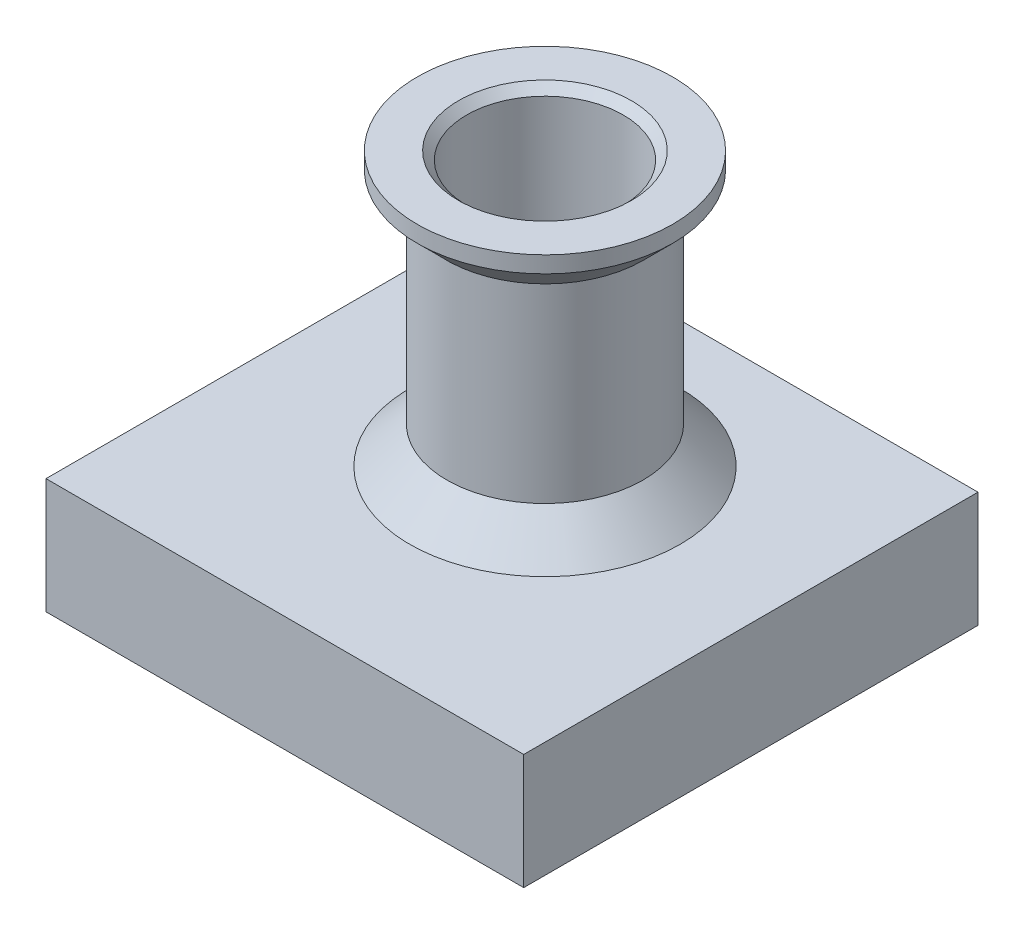
ISO-10303-21;
HEADER;
FILE_DESCRIPTION(('STEP AP214'),'2;1');
FILE_NAME('part.step','',(''),(''),'','','');
FILE_SCHEMA(('AUTOMOTIVE_DESIGN { 1 0 10303 214 1 1 1 1 }'));
ENDSEC;
DATA;
#1=APPLICATION_CONTEXT('core data for automotive mechanical design processes');
#2=APPLICATION_PROTOCOL_DEFINITION('international standard','automotive_design',2000,#1);
#3=PRODUCT_CONTEXT('',#1,'mechanical');
#4=PRODUCT('Part','Part','',(#3));
#5=PRODUCT_RELATED_PRODUCT_CATEGORY('part','',(#4));
#6=PRODUCT_DEFINITION_FORMATION('','',#4);
#7=PRODUCT_DEFINITION_CONTEXT('part definition',#1,'design');
#8=PRODUCT_DEFINITION('design','',#6,#7);
#9=PRODUCT_DEFINITION_SHAPE('','',#8);
#10=(LENGTH_UNIT() NAMED_UNIT(*) SI_UNIT(.MILLI.,.METRE.));
#11=(NAMED_UNIT(*) PLANE_ANGLE_UNIT() SI_UNIT($,.RADIAN.));
#12=(NAMED_UNIT(*) SI_UNIT($,.STERADIAN.) SOLID_ANGLE_UNIT());
#13=UNCERTAINTY_MEASURE_WITH_UNIT(LENGTH_MEASURE(1.E-05),#10,'distance_accuracy_value','');
#14=(GEOMETRIC_REPRESENTATION_CONTEXT(3) GLOBAL_UNCERTAINTY_ASSIGNED_CONTEXT((#13)) GLOBAL_UNIT_ASSIGNED_CONTEXT((#10,
#11,#12)) REPRESENTATION_CONTEXT('',''));
#15=CARTESIAN_POINT('',(0.,0.,0.));
#16=DIRECTION('',(0.,0.,1.));
#17=DIRECTION('',(1.,0.,0.));
#18=AXIS2_PLACEMENT_3D('',#15,#16,#17);
#19=CARTESIAN_POINT('',(0.,-12.923275862069,0.));
#20=DIRECTION('',(0.,-1.,0.));
#21=DIRECTION('',(1.,0.,0.));
#22=AXIS2_PLACEMENT_3D('',#19,#20,#21);
#23=CYLINDRICAL_SURFACE('',#22,3.6);
#24=CARTESIAN_POINT('',(0.,-1.15000000000001,0.));
#25=DIRECTION('',(0.,-1.,0.));
#26=DIRECTION('',(1.,0.,0.));
#27=AXIS2_PLACEMENT_3D('',#24,#25,#26);
#28=CIRCLE('',#27,3.6);
#29=CARTESIAN_POINT('',(3.6,-1.15000000000001,0.));
#30=VERTEX_POINT('',#29);
#31=EDGE_CURVE('E153',#30,#30,#28,.T.);
#32=ORIENTED_EDGE('',*,*,#31,.F.);
#33=EDGE_LOOP('',(#32));
#34=FACE_BOUND('',#33,.T.);
#35=CARTESIAN_POINT('',(0.,-8.09347301242441,0.));
#36=DIRECTION('',(0.,-1.,0.));
#37=DIRECTION('',(1.,0.,0.));
#38=AXIS2_PLACEMENT_3D('',#35,#36,#37);
#39=CIRCLE('',#38,3.6);
#40=CARTESIAN_POINT('',(3.6,-8.09347301242441,0.));
#41=VERTEX_POINT('',#40);
#42=EDGE_CURVE('E125',#41,#41,#39,.T.);
#43=ORIENTED_EDGE('',*,*,#42,.T.);
#44=EDGE_LOOP('',(#43));
#45=FACE_BOUND('',#44,.T.);
#46=ADVANCED_FACE('F34',(#34,#45),#23,.F.);
#47=CARTESIAN_POINT('',(22.,-13.5934730124244,0.));
#48=DIRECTION('',(0.,-1.,0.));
#49=DIRECTION('',(1.,0.,0.));
#50=AXIS2_PLACEMENT_3D('',#47,#48,#49);
#51=PLANE('',#50);
#52=DIRECTION('',(0.,0.,-1.));
#53=VECTOR('',#52,1.);
#54=CARTESIAN_POINT('',(-8.5,-13.5934730124244,0.));
#55=LINE('',#54,#53);
#56=CARTESIAN_POINT('',(-8.5,-13.5934730124244,12.715));
#57=VERTEX_POINT('',#56);
#58=CARTESIAN_POINT('',(-8.5,-13.5934730124244,-4.285));
#59=VERTEX_POINT('',#58);
#60=EDGE_CURVE('E12',#57,#59,#55,.T.);
#61=ORIENTED_EDGE('',*,*,#60,.F.);
#62=DIRECTION('',(-1.,0.,0.));
#63=VECTOR('',#62,1.);
#64=CARTESIAN_POINT('',(22.,-13.5934730124244,12.715));
#65=LINE('',#64,#63);
#66=CARTESIAN_POINT('',(8.5,-13.5934730124244,12.715));
#67=VERTEX_POINT('',#66);
#68=EDGE_CURVE('E42',#67,#57,#65,.T.);
#69=ORIENTED_EDGE('',*,*,#68,.F.);
#70=DIRECTION('',(0.,0.,1.));
#71=VECTOR('',#70,1.);
#72=CARTESIAN_POINT('',(8.5,-13.5934730124244,0.));
#73=LINE('',#72,#71);
#74=CARTESIAN_POINT('',(8.5,-13.5934730124244,-4.285));
#75=VERTEX_POINT('',#74);
#76=EDGE_CURVE('E193',#75,#67,#73,.T.);
#77=ORIENTED_EDGE('',*,*,#76,.F.);
#78=DIRECTION('',(1.,0.,0.));
#79=VECTOR('',#78,1.);
#80=CARTESIAN_POINT('',(22.,-13.5934730124244,-4.285));
#81=LINE('',#80,#79);
#82=EDGE_CURVE('E189',#59,#75,#81,.T.);
#83=ORIENTED_EDGE('',*,*,#82,.F.);
#84=EDGE_LOOP('',(#61,#69,#77,#83));
#85=FACE_BOUND('',#84,.T.);
#86=DIRECTION('',(-1.,0.,0.));
#87=VECTOR('',#86,1.);
#88=CARTESIAN_POINT('',(-14.4934077622866,-13.5934730124244,-11.7819131994107));
#89=LINE('',#88,#87);
#90=CARTESIAN_POINT('',(14.4934077622866,-13.5934730124244,-11.7819131994107));
#91=VERTEX_POINT('',#90);
#92=CARTESIAN_POINT('',(-14.4934077622866,-13.5934730124244,-11.7819131994107));
#93=VERTEX_POINT('',#92);
#94=EDGE_CURVE('E131',#91,#93,#89,.T.);
#95=ORIENTED_EDGE('',*,*,#94,.F.);
#96=DIRECTION('',(0.,0.,-1.));
#97=VECTOR('',#96,1.);
#98=CARTESIAN_POINT('',(14.4934077622866,-13.5934730124244,-11.7819131994107));
#99=LINE('',#98,#97);
#100=CARTESIAN_POINT('',(14.4934077622866,-13.5934730124244,15.7819131994107));
#101=VERTEX_POINT('',#100);
#102=EDGE_CURVE('E56',#101,#91,#99,.T.);
#103=ORIENTED_EDGE('',*,*,#102,.F.);
#104=DIRECTION('',(1.,0.,0.));
#105=VECTOR('',#104,1.);
#106=CARTESIAN_POINT('',(-14.4934077622866,-13.5934730124244,15.7819131994107));
#107=LINE('',#106,#105);
#108=CARTESIAN_POINT('',(-14.4934077622866,-13.5934730124244,15.7819131994107));
#109=VERTEX_POINT('',#108);
#110=EDGE_CURVE('E137',#109,#101,#107,.T.);
#111=ORIENTED_EDGE('',*,*,#110,.F.);
#112=DIRECTION('',(0.,0.,1.));
#113=VECTOR('',#112,1.);
#114=CARTESIAN_POINT('',(-14.4934077622866,-13.5934730124244,-11.7819131994107));
#115=LINE('',#114,#113);
#116=EDGE_CURVE('E134',#93,#109,#115,.T.);
#117=ORIENTED_EDGE('',*,*,#116,.F.);
#118=EDGE_LOOP('',(#95,#103,#111,#117));
#119=FACE_BOUND('',#118,.T.);
#120=ADVANCED_FACE('F199',(#85,#119),#51,.T.);
#121=CARTESIAN_POINT('',(8.20084289882044,-6.59347301242441,0.));
#122=DIRECTION('',(0.,1.,0.));
#123=DIRECTION('',(-1.,0.,0.));
#124=AXIS2_PLACEMENT_3D('',#121,#122,#123);
#125=PLANE('',#124);
#126=CARTESIAN_POINT('',(0.,-6.59347301242441,0.));
#127=DIRECTION('',(0.,-1.,0.));
#128=DIRECTION('',(1.,0.,0.));
#129=AXIS2_PLACEMENT_3D('',#126,#127,#128);
#130=CIRCLE('',#129,8.20084289882044);
#131=CARTESIAN_POINT('',(8.20084289882044,-6.59347301242441,0.));
#132=VERTEX_POINT('',#131);
#133=EDGE_CURVE('E144',#132,#132,#130,.T.);
#134=ORIENTED_EDGE('',*,*,#133,.T.);
#135=EDGE_LOOP('',(#134));
#136=FACE_BOUND('',#135,.T.);
#137=DIRECTION('',(1.,0.,0.));
#138=VECTOR('',#137,1.);
#139=CARTESIAN_POINT('',(8.20084289882044,-6.59347301242441,15.7819131994107));
#140=LINE('',#139,#138);
#141=CARTESIAN_POINT('',(-14.4934077622866,-6.59347301242441,15.7819131994107));
#142=VERTEX_POINT('',#141);
#143=CARTESIAN_POINT('',(14.4934077622866,-6.59347301242441,15.7819131994107));
#144=VERTEX_POINT('',#143);
#145=EDGE_CURVE('E183',#142,#144,#140,.T.);
#146=ORIENTED_EDGE('',*,*,#145,.T.);
#147=DIRECTION('',(0.,0.,-1.));
#148=VECTOR('',#147,1.);
#149=CARTESIAN_POINT('',(14.4934077622866,-6.59347301242441,0.));
#150=LINE('',#149,#148);
#151=CARTESIAN_POINT('',(14.4934077622866,-6.59347301242441,-11.7819131994107));
#152=VERTEX_POINT('',#151);
#153=EDGE_CURVE('E186',#144,#152,#150,.T.);
#154=ORIENTED_EDGE('',*,*,#153,.T.);
#155=DIRECTION('',(-1.,0.,0.));
#156=VECTOR('',#155,1.);
#157=CARTESIAN_POINT('',(8.20084289882044,-6.59347301242441,-11.7819131994107));
#158=LINE('',#157,#156);
#159=CARTESIAN_POINT('',(-14.4934077622866,-6.59347301242441,-11.7819131994107));
#160=VERTEX_POINT('',#159);
#161=EDGE_CURVE('E177',#152,#160,#158,.T.);
#162=ORIENTED_EDGE('',*,*,#161,.T.);
#163=DIRECTION('',(0.,0.,1.));
#164=VECTOR('',#163,1.);
#165=CARTESIAN_POINT('',(-14.4934077622866,-6.59347301242441,0.));
#166=LINE('',#165,#164);
#167=EDGE_CURVE('E180',#160,#142,#166,.T.);
#168=ORIENTED_EDGE('',*,*,#167,.T.);
#169=EDGE_LOOP('',(#146,#154,#162,#168));
#170=FACE_BOUND('',#169,.T.);
#171=ADVANCED_FACE('F217',(#136,#170),#125,.T.);
#172=CARTESIAN_POINT('',(0.,-6.59347301242441,0.));
#173=DIRECTION('',(0.,-1.,0.));
#174=DIRECTION('',(1.,0.,0.));
#175=AXIS2_PLACEMENT_3D('',#172,#173,#174);
#176=CONICAL_SURFACE('',#175,8.20084289882044,0.785398163397449);
#177=CARTESIAN_POINT('',(0.,-4.34263011360397,0.));
#178=DIRECTION('',(0.,-1.,0.));
#179=DIRECTION('',(1.,0.,0.));
#180=AXIS2_PLACEMENT_3D('',#177,#178,#179);
#181=CIRCLE('',#180,5.95);
#182=CARTESIAN_POINT('',(5.95,-4.34263011360397,0.));
#183=VERTEX_POINT('',#182);
#184=EDGE_CURVE('E174',#183,#183,#181,.T.);
#185=ORIENTED_EDGE('',*,*,#184,.T.);
#186=EDGE_LOOP('',(#185));
#187=FACE_BOUND('',#186,.T.);
#188=ORIENTED_EDGE('',*,*,#133,.F.);
#189=EDGE_LOOP('',(#188));
#190=FACE_BOUND('',#189,.T.);
#191=ADVANCED_FACE('F36',(#187,#190),#176,.T.);
#192=CARTESIAN_POINT('',(0.,-12.923275862069,0.));
#193=DIRECTION('',(0.,-1.,0.));
#194=DIRECTION('',(1.,0.,0.));
#195=AXIS2_PLACEMENT_3D('',#192,#193,#194);
#196=CYLINDRICAL_SURFACE('',#195,5.95);
#197=CARTESIAN_POINT('',(0.,7.20000000000002,0.));
#198=DIRECTION('',(0.,-1.,0.));
#199=DIRECTION('',(1.,0.,0.));
#200=AXIS2_PLACEMENT_3D('',#197,#198,#199);
#201=CIRCLE('',#200,5.95000000000001);
#202=CARTESIAN_POINT('',(5.95000000000001,7.20000000000002,0.));
#203=VERTEX_POINT('',#202);
#204=EDGE_CURVE('E171',#203,#203,#201,.T.);
#205=ORIENTED_EDGE('',*,*,#204,.T.);
#206=EDGE_LOOP('',(#205));
#207=FACE_BOUND('',#206,.T.);
#208=ORIENTED_EDGE('',*,*,#184,.F.);
#209=EDGE_LOOP('',(#208));
#210=FACE_BOUND('',#209,.T.);
#211=ADVANCED_FACE('F246',(#207,#210),#196,.T.);
#212=CARTESIAN_POINT('',(0.,7.20000000000002,0.));
#213=DIRECTION('',(0.,1.,0.));
#214=DIRECTION('',(-1.,0.,0.));
#215=AXIS2_PLACEMENT_3D('',#212,#213,#214);
#216=CONICAL_SURFACE('',#215,5.95000000000001,0.785398163397454);
#217=CARTESIAN_POINT('',(0.,9.,0.));
#218=DIRECTION('',(0.,-1.,0.));
#219=DIRECTION('',(1.,0.,0.));
#220=AXIS2_PLACEMENT_3D('',#217,#218,#219);
#221=CIRCLE('',#220,7.75);
#222=CARTESIAN_POINT('',(7.75,9.,0.));
#223=VERTEX_POINT('',#222);
#224=EDGE_CURVE('E168',#223,#223,#221,.T.);
#225=ORIENTED_EDGE('',*,*,#224,.T.);
#226=EDGE_LOOP('',(#225));
#227=FACE_BOUND('',#226,.T.);
#228=ORIENTED_EDGE('',*,*,#204,.F.);
#229=EDGE_LOOP('',(#228));
#230=FACE_BOUND('',#229,.T.);
#231=ADVANCED_FACE('F243',(#227,#230),#216,.T.);
#232=CARTESIAN_POINT('',(0.,-12.923275862069,0.));
#233=DIRECTION('',(0.,-1.,0.));
#234=DIRECTION('',(1.,0.,0.));
#235=AXIS2_PLACEMENT_3D('',#232,#233,#234);
#236=CYLINDRICAL_SURFACE('',#235,7.75);
#237=CARTESIAN_POINT('',(0.,10.,0.));
#238=DIRECTION('',(0.,-1.,0.));
#239=DIRECTION('',(1.,0.,0.));
#240=AXIS2_PLACEMENT_3D('',#237,#238,#239);
#241=CIRCLE('',#240,7.75);
#242=CARTESIAN_POINT('',(7.75,10.,0.));
#243=VERTEX_POINT('',#242);
#244=EDGE_CURVE('E165',#243,#243,#241,.T.);
#245=ORIENTED_EDGE('',*,*,#244,.T.);
#246=EDGE_LOOP('',(#245));
#247=FACE_BOUND('',#246,.T.);
#248=ORIENTED_EDGE('',*,*,#224,.F.);
#249=EDGE_LOOP('',(#248));
#250=FACE_BOUND('',#249,.T.);
#251=ADVANCED_FACE('F239',(#247,#250),#236,.T.);
#252=CARTESIAN_POINT('',(5.25,10.,0.));
#253=DIRECTION('',(0.,1.,0.));
#254=DIRECTION('',(-1.,0.,0.));
#255=AXIS2_PLACEMENT_3D('',#252,#253,#254);
#256=PLANE('',#255);
#257=CARTESIAN_POINT('',(0.,10.,0.));
#258=DIRECTION('',(0.,-1.,0.));
#259=DIRECTION('',(1.,0.,0.));
#260=AXIS2_PLACEMENT_3D('',#257,#258,#259);
#261=CIRCLE('',#260,5.25);
#262=CARTESIAN_POINT('',(5.25,10.,0.));
#263=VERTEX_POINT('',#262);
#264=EDGE_CURVE('E162',#263,#263,#261,.T.);
#265=ORIENTED_EDGE('',*,*,#264,.T.);
#266=EDGE_LOOP('',(#265));
#267=FACE_BOUND('',#266,.T.);
#268=ORIENTED_EDGE('',*,*,#244,.F.);
#269=EDGE_LOOP('',(#268));
#270=FACE_BOUND('',#269,.T.);
#271=ADVANCED_FACE('F235',(#267,#270),#256,.T.);
#272=CARTESIAN_POINT('',(0.,10.,0.));
#273=DIRECTION('',(0.,1.,0.));
#274=DIRECTION('',(-1.,0.,0.));
#275=AXIS2_PLACEMENT_3D('',#272,#273,#274);
#276=CONICAL_SURFACE('',#275,5.25,0.785398163397447);
#277=CARTESIAN_POINT('',(0.,9.5,0.));
#278=DIRECTION('',(0.,-1.,0.));
#279=DIRECTION('',(1.,0.,0.));
#280=AXIS2_PLACEMENT_3D('',#277,#278,#279);
#281=CIRCLE('',#280,4.75);
#282=CARTESIAN_POINT('',(4.75,9.5,0.));
#283=VERTEX_POINT('',#282);
#284=EDGE_CURVE('E159',#283,#283,#281,.T.);
#285=ORIENTED_EDGE('',*,*,#284,.T.);
#286=EDGE_LOOP('',(#285));
#287=FACE_BOUND('',#286,.T.);
#288=ORIENTED_EDGE('',*,*,#264,.F.);
#289=EDGE_LOOP('',(#288));
#290=FACE_BOUND('',#289,.T.);
#291=ADVANCED_FACE('F231',(#287,#290),#276,.F.);
#292=CARTESIAN_POINT('',(0.,-12.923275862069,0.));
#293=DIRECTION('',(0.,-1.,0.));
#294=DIRECTION('',(1.,0.,0.));
#295=AXIS2_PLACEMENT_3D('',#292,#293,#294);
#296=CYLINDRICAL_SURFACE('',#295,4.75);
#297=CARTESIAN_POINT('',(0.,0.,0.));
#298=DIRECTION('',(0.,-1.,0.));
#299=DIRECTION('',(1.,0.,0.));
#300=AXIS2_PLACEMENT_3D('',#297,#298,#299);
#301=CIRCLE('',#300,4.75);
#302=CARTESIAN_POINT('',(4.75,0.,0.));
#303=VERTEX_POINT('',#302);
#304=EDGE_CURVE('E156',#303,#303,#301,.T.);
#305=ORIENTED_EDGE('',*,*,#304,.T.);
#306=EDGE_LOOP('',(#305));
#307=FACE_BOUND('',#306,.T.);
#308=ORIENTED_EDGE('',*,*,#284,.F.);
#309=EDGE_LOOP('',(#308));
#310=FACE_BOUND('',#309,.T.);
#311=ADVANCED_FACE('F227',(#307,#310),#296,.F.);
#312=CARTESIAN_POINT('',(0.,0.,0.));
#313=DIRECTION('',(0.,1.,0.));
#314=DIRECTION('',(-1.,0.,0.));
#315=AXIS2_PLACEMENT_3D('',#312,#313,#314);
#316=CONICAL_SURFACE('',#315,4.75,0.785398163397445);
#317=ORIENTED_EDGE('',*,*,#31,.T.);
#318=EDGE_LOOP('',(#317));
#319=FACE_BOUND('',#318,.T.);
#320=ORIENTED_EDGE('',*,*,#304,.F.);
#321=EDGE_LOOP('',(#320));
#322=FACE_BOUND('',#321,.T.);
#323=ADVANCED_FACE('F223',(#319,#322),#316,.F.);
#324=CARTESIAN_POINT('',(14.4934077622866,-13.5934730124244,-11.7819131994107));
#325=DIRECTION('',(1.,0.,0.));
#326=DIRECTION('',(0.,0.,-1.));
#327=AXIS2_PLACEMENT_3D('',#324,#325,#326);
#328=PLANE('',#327);
#329=DIRECTION('',(0.,1.,0.));
#330=VECTOR('',#329,1.);
#331=CARTESIAN_POINT('',(14.4934077622866,-13.5934730124244,15.7819131994107));
#332=LINE('',#331,#330);
#333=EDGE_CURVE('E141',#101,#144,#332,.T.);
#334=ORIENTED_EDGE('',*,*,#333,.F.);
#335=ORIENTED_EDGE('',*,*,#102,.T.);
#336=DIRECTION('',(0.,1.,0.));
#337=VECTOR('',#336,1.);
#338=CARTESIAN_POINT('',(14.4934077622866,-13.5934730124244,-11.7819131994107));
#339=LINE('',#338,#337);
#340=EDGE_CURVE('E140',#91,#152,#339,.T.);
#341=ORIENTED_EDGE('',*,*,#340,.T.);
#342=ORIENTED_EDGE('',*,*,#153,.F.);
#343=EDGE_LOOP('',(#334,#335,#341,#342));
#344=FACE_BOUND('',#343,.T.);
#345=ADVANCED_FACE('F226',(#344),#328,.T.);
#346=CARTESIAN_POINT('',(-14.4934077622866,-13.5934730124244,15.7819131994107));
#347=DIRECTION('',(0.,0.,1.));
#348=DIRECTION('',(1.,0.,0.));
#349=AXIS2_PLACEMENT_3D('',#346,#347,#348);
#350=PLANE('',#349);
#351=DIRECTION('',(0.,1.,0.));
#352=VECTOR('',#351,1.);
#353=CARTESIAN_POINT('',(-14.4934077622866,-13.5934730124244,15.7819131994107));
#354=LINE('',#353,#352);
#355=EDGE_CURVE('E145',#109,#142,#354,.T.);
#356=ORIENTED_EDGE('',*,*,#355,.F.);
#357=ORIENTED_EDGE('',*,*,#110,.T.);
#358=ORIENTED_EDGE('',*,*,#333,.T.);
#359=ORIENTED_EDGE('',*,*,#145,.F.);
#360=EDGE_LOOP('',(#356,#357,#358,#359));
#361=FACE_BOUND('',#360,.T.);
#362=ADVANCED_FACE('F264',(#361),#350,.T.);
#363=CARTESIAN_POINT('',(-14.4934077622866,-13.5934730124244,-11.7819131994107));
#364=DIRECTION('',(-1.,0.,0.));
#365=DIRECTION('',(0.,0.,1.));
#366=AXIS2_PLACEMENT_3D('',#363,#364,#365);
#367=PLANE('',#366);
#368=DIRECTION('',(0.,1.,0.));
#369=VECTOR('',#368,1.);
#370=CARTESIAN_POINT('',(-14.4934077622866,-13.5934730124244,-11.7819131994107));
#371=LINE('',#370,#369);
#372=EDGE_CURVE('E148',#93,#160,#371,.T.);
#373=ORIENTED_EDGE('',*,*,#372,.F.);
#374=ORIENTED_EDGE('',*,*,#116,.T.);
#375=ORIENTED_EDGE('',*,*,#355,.T.);
#376=ORIENTED_EDGE('',*,*,#167,.F.);
#377=EDGE_LOOP('',(#373,#374,#375,#376));
#378=FACE_BOUND('',#377,.T.);
#379=ADVANCED_FACE('F266',(#378),#367,.T.);
#380=CARTESIAN_POINT('',(-14.4934077622866,-13.5934730124244,-11.7819131994107));
#381=DIRECTION('',(0.,0.,-1.));
#382=DIRECTION('',(-1.,0.,0.));
#383=AXIS2_PLACEMENT_3D('',#380,#381,#382);
#384=PLANE('',#383);
#385=ORIENTED_EDGE('',*,*,#340,.F.);
#386=ORIENTED_EDGE('',*,*,#94,.T.);
#387=ORIENTED_EDGE('',*,*,#372,.T.);
#388=ORIENTED_EDGE('',*,*,#161,.F.);
#389=EDGE_LOOP('',(#385,#386,#387,#388));
#390=FACE_BOUND('',#389,.T.);
#391=ADVANCED_FACE('F271',(#390),#384,.T.);
#392=CARTESIAN_POINT('',(-8.5,-8.09347301242441,-4.285));
#393=DIRECTION('',(-1.,0.,0.));
#394=DIRECTION('',(0.,-1.,0.));
#395=AXIS2_PLACEMENT_3D('',#392,#393,#394);
#396=PLANE('',#395);
#397=ORIENTED_EDGE('',*,*,#60,.T.);
#398=DIRECTION('',(0.,-1.,0.));
#399=VECTOR('',#398,1.);
#400=CARTESIAN_POINT('',(-8.5,-8.09347301242441,-4.285));
#401=LINE('',#400,#399);
#402=CARTESIAN_POINT('',(-8.5,-8.09347301242441,-4.285));
#403=VERTEX_POINT('',#402);
#404=EDGE_CURVE('E49',#403,#59,#401,.T.);
#405=ORIENTED_EDGE('',*,*,#404,.F.);
#406=DIRECTION('',(0.,0.,-1.));
#407=VECTOR('',#406,1.);
#408=CARTESIAN_POINT('',(-8.5,-8.09347301242441,-4.285));
#409=LINE('',#408,#407);
#410=CARTESIAN_POINT('',(-8.5,-8.09347301242441,12.715));
#411=VERTEX_POINT('',#410);
#412=EDGE_CURVE('E101',#411,#403,#409,.T.);
#413=ORIENTED_EDGE('',*,*,#412,.F.);
#414=DIRECTION('',(0.,-1.,0.));
#415=VECTOR('',#414,1.);
#416=CARTESIAN_POINT('',(-8.5,-8.09347301242441,12.715));
#417=LINE('',#416,#415);
#418=EDGE_CURVE('E123',#411,#57,#417,.T.);
#419=ORIENTED_EDGE('',*,*,#418,.T.);
#420=EDGE_LOOP('',(#397,#405,#413,#419));
#421=FACE_BOUND('',#420,.T.);
#422=ADVANCED_FACE('F98',(#421),#396,.F.);
#423=CARTESIAN_POINT('',(8.5,-8.09347301242441,12.715));
#424=DIRECTION('',(0.,0.,1.));
#425=DIRECTION('',(1.,0.,0.));
#426=AXIS2_PLACEMENT_3D('',#423,#424,#425);
#427=PLANE('',#426);
#428=ORIENTED_EDGE('',*,*,#68,.T.);
#429=ORIENTED_EDGE('',*,*,#418,.F.);
#430=DIRECTION('',(-1.,0.,0.));
#431=VECTOR('',#430,1.);
#432=CARTESIAN_POINT('',(8.5,-8.09347301242441,12.715));
#433=LINE('',#432,#431);
#434=CARTESIAN_POINT('',(8.5,-8.09347301242441,12.715));
#435=VERTEX_POINT('',#434);
#436=EDGE_CURVE('E106',#435,#411,#433,.T.);
#437=ORIENTED_EDGE('',*,*,#436,.F.);
#438=DIRECTION('',(0.,-1.,0.));
#439=VECTOR('',#438,1.);
#440=CARTESIAN_POINT('',(8.5,-8.09347301242441,12.715));
#441=LINE('',#440,#439);
#442=EDGE_CURVE('E126',#435,#67,#441,.T.);
#443=ORIENTED_EDGE('',*,*,#442,.T.);
#444=EDGE_LOOP('',(#428,#429,#437,#443));
#445=FACE_BOUND('',#444,.T.);
#446=ADVANCED_FACE('F196',(#445),#427,.F.);
#447=CARTESIAN_POINT('',(8.5,-8.09347301242441,-4.285));
#448=DIRECTION('',(1.,0.,0.));
#449=DIRECTION('',(0.,1.,0.));
#450=AXIS2_PLACEMENT_3D('',#447,#448,#449);
#451=PLANE('',#450);
#452=ORIENTED_EDGE('',*,*,#76,.T.);
#453=ORIENTED_EDGE('',*,*,#442,.F.);
#454=DIRECTION('',(0.,0.,1.));
#455=VECTOR('',#454,1.);
#456=CARTESIAN_POINT('',(8.5,-8.09347301242441,-4.285));
#457=LINE('',#456,#455);
#458=CARTESIAN_POINT('',(8.5,-8.09347301242441,-4.285));
#459=VERTEX_POINT('',#458);
#460=EDGE_CURVE('E115',#459,#435,#457,.T.);
#461=ORIENTED_EDGE('',*,*,#460,.F.);
#462=DIRECTION('',(0.,-1.,0.));
#463=VECTOR('',#462,1.);
#464=CARTESIAN_POINT('',(8.5,-8.09347301242441,-4.285));
#465=LINE('',#464,#463);
#466=EDGE_CURVE('E105',#459,#75,#465,.T.);
#467=ORIENTED_EDGE('',*,*,#466,.T.);
#468=EDGE_LOOP('',(#452,#453,#461,#467));
#469=FACE_BOUND('',#468,.T.);
#470=ADVANCED_FACE('F202',(#469),#451,.F.);
#471=CARTESIAN_POINT('',(8.5,-8.09347301242441,-4.285));
#472=DIRECTION('',(0.,0.,-1.));
#473=DIRECTION('',(-1.,0.,0.));
#474=AXIS2_PLACEMENT_3D('',#471,#472,#473);
#475=PLANE('',#474);
#476=ORIENTED_EDGE('',*,*,#82,.T.);
#477=ORIENTED_EDGE('',*,*,#466,.F.);
#478=DIRECTION('',(1.,0.,0.));
#479=VECTOR('',#478,1.);
#480=CARTESIAN_POINT('',(8.5,-8.09347301242441,-4.285));
#481=LINE('',#480,#479);
#482=EDGE_CURVE('E109',#403,#459,#481,.T.);
#483=ORIENTED_EDGE('',*,*,#482,.F.);
#484=ORIENTED_EDGE('',*,*,#404,.T.);
#485=EDGE_LOOP('',(#476,#477,#483,#484));
#486=FACE_BOUND('',#485,.T.);
#487=ADVANCED_FACE('F110',(#486),#475,.F.);
#488=CARTESIAN_POINT('',(0.,-8.09347301242441,0.));
#489=DIRECTION('',(0.,-1.,0.));
#490=DIRECTION('',(1.,0.,0.));
#491=AXIS2_PLACEMENT_3D('',#488,#489,#490);
#492=PLANE('',#491);
#493=ORIENTED_EDGE('',*,*,#42,.F.);
#494=EDGE_LOOP('',(#493));
#495=FACE_BOUND('',#494,.T.);
#496=ORIENTED_EDGE('',*,*,#412,.T.);
#497=ORIENTED_EDGE('',*,*,#482,.T.);
#498=ORIENTED_EDGE('',*,*,#460,.T.);
#499=ORIENTED_EDGE('',*,*,#436,.T.);
#500=EDGE_LOOP('',(#496,#497,#498,#499));
#501=FACE_BOUND('',#500,.T.);
#502=ADVANCED_FACE('F117',(#495,#501),#492,.T.);
#503=CLOSED_SHELL('',(#46,#120,#171,#191,#211,#231,#251,#271,#291,#311,#323,#345,#362,#379,#391,
#422,#446,#470,#487,#502));
#504=MANIFOLD_SOLID_BREP('B2',#503);
#505=ADVANCED_BREP_SHAPE_REPRESENTATION('',(#18,#504),#14);
#506=SHAPE_DEFINITION_REPRESENTATION(#9,#505);
ENDSEC;
END-ISO-10303-21;
